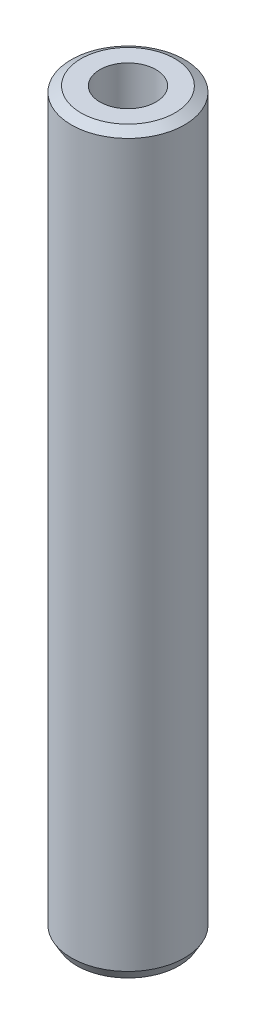
ISO-10303-21;
HEADER;
FILE_DESCRIPTION(('STEP AP214'),'2;1');
FILE_NAME('part.step','',(''),(''),'','','');
FILE_SCHEMA(('AUTOMOTIVE_DESIGN { 1 0 10303 214 1 1 1 1 }'));
ENDSEC;
DATA;
#1=APPLICATION_CONTEXT('core data for automotive mechanical design processes');
#2=APPLICATION_PROTOCOL_DEFINITION('international standard','automotive_design',2000,#1);
#3=PRODUCT_CONTEXT('',#1,'mechanical');
#4=PRODUCT('Part','Part','',(#3));
#5=PRODUCT_RELATED_PRODUCT_CATEGORY('part','',(#4));
#6=PRODUCT_DEFINITION_FORMATION('','',#4);
#7=PRODUCT_DEFINITION_CONTEXT('part definition',#1,'design');
#8=PRODUCT_DEFINITION('design','',#6,#7);
#9=PRODUCT_DEFINITION_SHAPE('','',#8);
#10=(LENGTH_UNIT() NAMED_UNIT(*) SI_UNIT(.MILLI.,.METRE.));
#11=(NAMED_UNIT(*) PLANE_ANGLE_UNIT() SI_UNIT($,.RADIAN.));
#12=(NAMED_UNIT(*) SI_UNIT($,.STERADIAN.) SOLID_ANGLE_UNIT());
#13=UNCERTAINTY_MEASURE_WITH_UNIT(LENGTH_MEASURE(1.E-05),#10,'distance_accuracy_value','');
#14=(GEOMETRIC_REPRESENTATION_CONTEXT(3) GLOBAL_UNCERTAINTY_ASSIGNED_CONTEXT((#13)) GLOBAL_UNIT_ASSIGNED_CONTEXT((#10,
#11,#12)) REPRESENTATION_CONTEXT('',''));
#15=CARTESIAN_POINT('',(0.,0.,0.));
#16=DIRECTION('',(0.,0.,1.));
#17=DIRECTION('',(1.,0.,0.));
#18=AXIS2_PLACEMENT_3D('',#15,#16,#17);
#19=CARTESIAN_POINT('',(0.,520.418091339819,0.));
#20=DIRECTION('',(0.,-1.,0.));
#21=DIRECTION('',(0.,0.,-1.));
#22=AXIS2_PLACEMENT_3D('',#19,#20,#21);
#23=CYLINDRICAL_SURFACE('',#22,40.);
#24=CARTESIAN_POINT('',(0.,516.489743662815,0.));
#25=DIRECTION('',(0.,1.,0.));
#26=DIRECTION('',(0.,0.,1.));
#27=AXIS2_PLACEMENT_3D('',#24,#25,#26);
#28=CIRCLE('',#27,40.);
#29=CARTESIAN_POINT('',(0.,516.489743662815,40.));
#30=VERTEX_POINT('',#29);
#31=EDGE_CURVE('E50',#30,#30,#28,.F.);
#32=ORIENTED_EDGE('',*,*,#31,.T.);
#33=EDGE_LOOP('',(#32));
#34=FACE_BOUND('',#33,.T.);
#35=CARTESIAN_POINT('',(0.,6.80409776636581,0.));
#36=DIRECTION('',(0.,1.,0.));
#37=DIRECTION('',(0.,0.,1.));
#38=AXIS2_PLACEMENT_3D('',#35,#36,#37);
#39=CIRCLE('',#38,40.);
#40=CARTESIAN_POINT('',(0.,6.80409776636581,40.));
#41=VERTEX_POINT('',#40);
#42=EDGE_CURVE('E51',#41,#41,#39,.T.);
#43=ORIENTED_EDGE('',*,*,#42,.T.);
#44=EDGE_LOOP('',(#43));
#45=FACE_BOUND('',#44,.T.);
#46=ADVANCED_FACE('F39',(#34,#45),#23,.T.);
#47=CARTESIAN_POINT('',(0.,520.418091339819,0.));
#48=DIRECTION('',(0.,1.,0.));
#49=DIRECTION('',(0.,0.,1.));
#50=AXIS2_PLACEMENT_3D('',#47,#48,#49);
#51=PLANE('',#50);
#52=CARTESIAN_POINT('',(0.,520.418091339819,0.));
#53=DIRECTION('',(0.,1.,0.));
#54=DIRECTION('',(0.,0.,1.));
#55=AXIS2_PLACEMENT_3D('',#52,#53,#54);
#56=CIRCLE('',#55,33.1959022336339);
#57=CARTESIAN_POINT('',(0.,520.418091339819,33.1959022336339));
#58=VERTEX_POINT('',#57);
#59=EDGE_CURVE('E54',#58,#58,#56,.T.);
#60=ORIENTED_EDGE('',*,*,#59,.T.);
#61=EDGE_LOOP('',(#60));
#62=FACE_BOUND('',#61,.T.);
#63=CARTESIAN_POINT('',(0.,520.418091339819,0.));
#64=DIRECTION('',(0.,1.,0.));
#65=DIRECTION('',(0.,0.,1.));
#66=AXIS2_PLACEMENT_3D('',#63,#64,#65);
#67=CIRCLE('',#66,19.8319330846607);
#68=CARTESIAN_POINT('',(0.,520.418091339819,19.8319330846607));
#69=VERTEX_POINT('',#68);
#70=EDGE_CURVE('E58',#69,#69,#67,.T.);
#71=ORIENTED_EDGE('',*,*,#70,.F.);
#72=EDGE_LOOP('',(#71));
#73=FACE_BOUND('',#72,.T.);
#74=ADVANCED_FACE('F69',(#62,#73),#51,.T.);
#75=CARTESIAN_POINT('',(0.,0.,0.));
#76=DIRECTION('',(0.,1.,0.));
#77=DIRECTION('',(0.,0.,1.));
#78=AXIS2_PLACEMENT_3D('',#75,#76,#77);
#79=PLANE('',#78);
#80=CARTESIAN_POINT('',(0.,0.,0.));
#81=DIRECTION('',(0.,1.,0.));
#82=DIRECTION('',(0.,0.,1.));
#83=AXIS2_PLACEMENT_3D('',#80,#81,#82);
#84=CIRCLE('',#83,36.0716523229961);
#85=CARTESIAN_POINT('',(0.,0.,36.0716523229961));
#86=VERTEX_POINT('',#85);
#87=EDGE_CURVE('E10',#86,#86,#84,.F.);
#88=ORIENTED_EDGE('',*,*,#87,.T.);
#89=EDGE_LOOP('',(#88));
#90=FACE_BOUND('',#89,.T.);
#91=CARTESIAN_POINT('',(0.,0.,0.));
#92=DIRECTION('',(0.,1.,0.));
#93=DIRECTION('',(0.,0.,1.));
#94=AXIS2_PLACEMENT_3D('',#91,#92,#93);
#95=CIRCLE('',#94,19.8319330846607);
#96=CARTESIAN_POINT('',(0.,0.,19.8319330846607));
#97=VERTEX_POINT('',#96);
#98=EDGE_CURVE('E63',#97,#97,#95,.T.);
#99=ORIENTED_EDGE('',*,*,#98,.T.);
#100=EDGE_LOOP('',(#99));
#101=FACE_BOUND('',#100,.T.);
#102=ADVANCED_FACE('F75',(#90,#101),#79,.F.);
#103=CARTESIAN_POINT('',(0.,520.418091339819,0.));
#104=DIRECTION('',(0.,-1.,0.));
#105=DIRECTION('',(0.,0.,-1.));
#106=AXIS2_PLACEMENT_3D('',#103,#104,#105);
#107=CYLINDRICAL_SURFACE('',#106,19.8319330846607);
#108=ORIENTED_EDGE('',*,*,#70,.T.);
#109=EDGE_LOOP('',(#108));
#110=FACE_BOUND('',#109,.T.);
#111=ORIENTED_EDGE('',*,*,#98,.F.);
#112=EDGE_LOOP('',(#111));
#113=FACE_BOUND('',#112,.T.);
#114=ADVANCED_FACE('F70',(#110,#113),#107,.F.);
#115=CARTESIAN_POINT('',(0.,520.418091339819,0.));
#116=DIRECTION('',(0.,-1.,0.));
#117=DIRECTION('',(0.,0.,-1.));
#118=AXIS2_PLACEMENT_3D('',#115,#116,#117);
#119=CONICAL_SURFACE('',#118,33.1959022336339,1.04719755119661);
#120=ORIENTED_EDGE('',*,*,#31,.F.);
#121=EDGE_LOOP('',(#120));
#122=FACE_BOUND('',#121,.T.);
#123=ORIENTED_EDGE('',*,*,#59,.F.);
#124=EDGE_LOOP('',(#123));
#125=FACE_BOUND('',#124,.T.);
#126=ADVANCED_FACE('F81',(#122,#125),#119,.T.);
#127=CARTESIAN_POINT('',(0.,6.80409776636581,0.));
#128=DIRECTION('',(0.,1.,0.));
#129=DIRECTION('',(0.,0.,1.));
#130=AXIS2_PLACEMENT_3D('',#127,#128,#129);
#131=CONICAL_SURFACE('',#130,40.,0.523598775598305);
#132=CARTESIAN_POINT('',(0.,0.,36.0716523229961));
#133=CARTESIAN_POINT('',(0.,0.0708760183996446,36.1125726112982));
#134=CARTESIAN_POINT('',(0.,0.141752036799288,36.1534928996004));
#135=CARTESIAN_POINT('',(0.,0.283504073598575,36.2353334762046));
#136=CARTESIAN_POINT('',(0.,0.354380091998218,36.2762537645067));
#137=CARTESIAN_POINT('',(0.,0.496132128797506,36.358094341111));
#138=CARTESIAN_POINT('',(0.,0.567008147197151,36.3990146294131));
#139=CARTESIAN_POINT('',(0.,0.708760183996438,36.4808552060173));
#140=CARTESIAN_POINT('',(0.,0.779636202396081,36.5217754943195));
#141=CARTESIAN_POINT('',(0.,0.921388239195369,36.6036160709237));
#142=CARTESIAN_POINT('',(0.,0.992264257595014,36.6445363592258));
#143=CARTESIAN_POINT('',(0.,1.1340162943943,36.7263769358301));
#144=CARTESIAN_POINT('',(0.,1.20489231279394,36.7672972241322));
#145=CARTESIAN_POINT('',(0.,1.34664434959323,36.8491378007365));
#146=CARTESIAN_POINT('',(0.,1.41752036799288,36.8900580890386));
#147=CARTESIAN_POINT('',(0.,1.55927240479217,36.9718986656428));
#148=CARTESIAN_POINT('',(0.,1.63014842319181,37.012818953945));
#149=CARTESIAN_POINT('',(0.,1.7719004599911,37.0946595305492));
#150=CARTESIAN_POINT('',(0.,1.84277647839074,37.1355798188513));
#151=CARTESIAN_POINT('',(0.,1.98452851519003,37.2174203954556));
#152=CARTESIAN_POINT('',(0.,2.05540453358967,37.2583406837577));
#153=CARTESIAN_POINT('',(0.,2.19715657038896,37.340181260362));
#154=CARTESIAN_POINT('',(0.,2.2680325887886,37.3811015486641));
#155=CARTESIAN_POINT('',(0.,2.40978462558789,37.4629421252683));
#156=CARTESIAN_POINT('',(0.,2.48066064398754,37.5038624135704));
#157=CARTESIAN_POINT('',(0.,2.62241268078682,37.5857029901747));
#158=CARTESIAN_POINT('',(0.,2.69328869918647,37.6266232784768));
#159=CARTESIAN_POINT('',(0.,2.83504073598576,37.7084638550811));
#160=CARTESIAN_POINT('',(0.,2.9059167543854,37.7493841433832));
#161=CARTESIAN_POINT('',(0.,3.04766879118469,37.8312247199874));
#162=CARTESIAN_POINT('',(0.,3.11854480958433,37.8721450082896));
#163=CARTESIAN_POINT('',(0.,3.26029684638362,37.9539855848938));
#164=CARTESIAN_POINT('',(0.,3.33117286478326,37.9949058731959));
#165=CARTESIAN_POINT('',(0.,3.47292490158255,38.0767464498002));
#166=CARTESIAN_POINT('',(0.,3.54380091998219,38.1176667381023));
#167=CARTESIAN_POINT('',(0.,3.68555295678148,38.1995073147066));
#168=CARTESIAN_POINT('',(0.,3.75642897518113,38.2404276030087));
#169=CARTESIAN_POINT('',(0.,3.89818101198041,38.3222681796129));
#170=CARTESIAN_POINT('',(0.,3.96905703038006,38.363188467915));
#171=CARTESIAN_POINT('',(0.,4.11080906717934,38.4450290445193));
#172=CARTESIAN_POINT('',(0.,4.18168508557899,38.4859493328214));
#173=CARTESIAN_POINT('',(0.,4.32343712237828,38.5677899094257));
#174=CARTESIAN_POINT('',(0.,4.39431314077792,38.6087101977278));
#175=CARTESIAN_POINT('',(0.,4.53606517757721,38.690550774332));
#176=CARTESIAN_POINT('',(0.,4.60694119597685,38.7314710626342));
#177=CARTESIAN_POINT('',(0.,4.74869323277614,38.8133116392384));
#178=CARTESIAN_POINT('',(0.,4.81956925117578,38.8542319275405));
#179=CARTESIAN_POINT('',(0.,4.96132128797507,38.9360725041448));
#180=CARTESIAN_POINT('',(0.,5.03219730637472,38.9769927924469));
#181=CARTESIAN_POINT('',(0.,5.173949343174,39.0588333690512));
#182=CARTESIAN_POINT('',(0.,5.24482536157365,39.0997536573533));
#183=CARTESIAN_POINT('',(0.,5.38657739837293,39.1815942339575));
#184=CARTESIAN_POINT('',(0.,5.45745341677258,39.2225145222596));
#185=CARTESIAN_POINT('',(0.,5.59920545357187,39.3043550988639));
#186=CARTESIAN_POINT('',(0.,5.67008147197151,39.345275387166));
#187=CARTESIAN_POINT('',(0.,5.8118335087708,39.4271159637703));
#188=CARTESIAN_POINT('',(0.,5.88270952717044,39.4680362520724));
#189=CARTESIAN_POINT('',(0.,6.02446156396973,39.5498768286766));
#190=CARTESIAN_POINT('',(0.,6.09533758236937,39.5907971169788));
#191=CARTESIAN_POINT('',(0.,6.23708961916866,39.672637693583));
#192=CARTESIAN_POINT('',(0.,6.30796563756831,39.7135579818851));
#193=CARTESIAN_POINT('',(0.,6.44971767436759,39.7953985584894));
#194=CARTESIAN_POINT('',(0.,6.52059369276724,39.8363188467915));
#195=CARTESIAN_POINT('',(0.,6.66234572956652,39.9181594233958));
#196=CARTESIAN_POINT('',(0.,6.73322174796617,39.9590797116979));
#197=CARTESIAN_POINT('',(0.,6.80409776636581,40.));
#198=B_SPLINE_CURVE_WITH_KNOTS('',3,(#132,#133,#134,#135,#136,#137,#138,#139,#140,#141,#142,
#143,#144,#145,#146,#147,#148,#149,#150,#151,#152,#153,#154,#155,#156,#157,#158,#159,#160,#161,
#162,#163,#164,#165,#166,#167,#168,#169,#170,#171,#172,#173,#174,#175,#176,#177,#178,#179,#180,
#181,#182,#183,#184,#185,#186,#187,#188,#189,#190,#191,#192,#193,#194,#195,#196,#197),
.UNSPECIFIED.,.F.,.F.,(4,2,2,2,2,2,2,2,2,2,2,2,2,2,2,2,2,2,2,2,2,2,2,2,2,2,2,2,2,2,2,2,4),(0.,
0.245521729812739,0.491043459625481,0.73656518943822,0.982086919250962,1.2276086490637,
1.47313037887644,1.71865210868918,1.96417383850192,2.20969556831466,2.45521729812741,
2.70073902794014,2.94626075775289,3.19178248756563,3.43730421737836,3.68282594719111,
3.92834767700385,4.17386940681659,4.41939113662933,4.66491286644207,4.91043459625481,
5.15595632606755,5.40147805588029,5.64699978569303,5.89252151550577,6.13804324531851,
6.38356497513125,6.629086704944,6.87460843475673,7.12013016456948,7.36565189438222,
7.61117362419496,7.8566953540077),.UNSPECIFIED.);
#199=EDGE_CURVE('BSEAM45',#86,#41,#198,.T.);
#200=ORIENTED_EDGE('',*,*,#87,.F.);
#201=ORIENTED_EDGE('',*,*,#42,.F.);
#202=ORIENTED_EDGE('',*,*,#199,.T.);
#203=ORIENTED_EDGE('',*,*,#199,.F.);
#204=EDGE_LOOP('',(#200,#202,#201,#203));
#205=FACE_BOUND('',#204,.T.);
#206=ADVANCED_FACE('F45',(#205),#131,.T.);
#207=CLOSED_SHELL('',(#46,#74,#102,#114,#126,#206));
#208=MANIFOLD_SOLID_BREP('B2',#207);
#209=ADVANCED_BREP_SHAPE_REPRESENTATION('',(#18,#208),#14);
#210=SHAPE_DEFINITION_REPRESENTATION(#9,#209);
ENDSEC;
END-ISO-10303-21;
